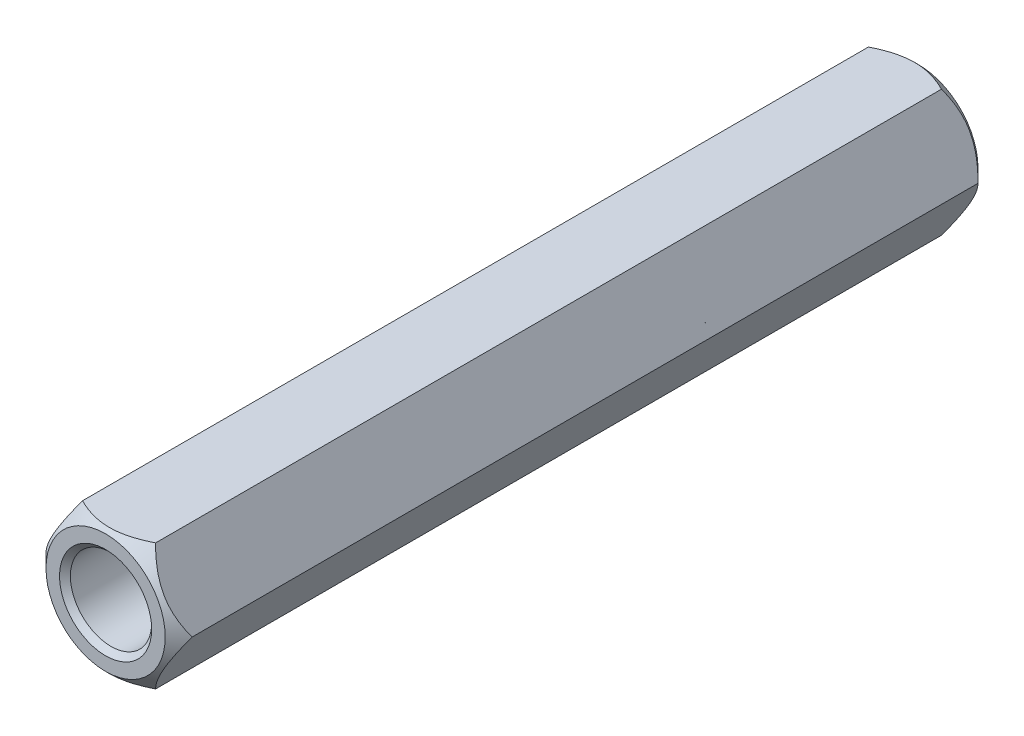
ISO-10303-21;
HEADER;
FILE_DESCRIPTION(('STEP AP214'),'2;1');
FILE_NAME('part.step','',(''),(''),'','','');
FILE_SCHEMA(('AUTOMOTIVE_DESIGN { 1 0 10303 214 1 1 1 1 }'));
ENDSEC;
DATA;
#1=APPLICATION_CONTEXT('core data for automotive mechanical design processes');
#2=APPLICATION_PROTOCOL_DEFINITION('international standard','automotive_design',2000,#1);
#3=PRODUCT_CONTEXT('',#1,'mechanical');
#4=PRODUCT('Part','Part','',(#3));
#5=PRODUCT_RELATED_PRODUCT_CATEGORY('part','',(#4));
#6=PRODUCT_DEFINITION_FORMATION('','',#4);
#7=PRODUCT_DEFINITION_CONTEXT('part definition',#1,'design');
#8=PRODUCT_DEFINITION('design','',#6,#7);
#9=PRODUCT_DEFINITION_SHAPE('','',#8);
#10=(LENGTH_UNIT() NAMED_UNIT(*) SI_UNIT(.MILLI.,.METRE.));
#11=(NAMED_UNIT(*) PLANE_ANGLE_UNIT() SI_UNIT($,.RADIAN.));
#12=(NAMED_UNIT(*) SI_UNIT($,.STERADIAN.) SOLID_ANGLE_UNIT());
#13=UNCERTAINTY_MEASURE_WITH_UNIT(LENGTH_MEASURE(1.E-05),#10,'distance_accuracy_value','');
#14=(GEOMETRIC_REPRESENTATION_CONTEXT(3) GLOBAL_UNCERTAINTY_ASSIGNED_CONTEXT((#13)) GLOBAL_UNIT_ASSIGNED_CONTEXT((#10,
#11,#12)) REPRESENTATION_CONTEXT('',''));
#15=CARTESIAN_POINT('',(0.,0.,0.));
#16=DIRECTION('',(0.,0.,1.));
#17=DIRECTION('',(1.,0.,0.));
#18=AXIS2_PLACEMENT_3D('',#15,#16,#17);
#19=CARTESIAN_POINT('',(0.,0.,30.));
#20=DIRECTION('',(0.,0.,1.));
#21=DIRECTION('',(1.,0.,0.));
#22=AXIS2_PLACEMENT_3D('',#19,#20,#21);
#23=PLANE('',#22);
#24=CARTESIAN_POINT('',(0.,0.,30.));
#25=DIRECTION('',(0.,0.,1.));
#26=DIRECTION('',(1.,0.,0.));
#27=AXIS2_PLACEMENT_3D('',#24,#25,#26);
#28=CIRCLE('',#27,2.19999999999999);
#29=CARTESIAN_POINT('',(2.19999999999999,0.,30.));
#30=VERTEX_POINT('',#29);
#31=EDGE_CURVE('E99',#30,#30,#28,.F.);
#32=ORIENTED_EDGE('',*,*,#31,.F.);
#33=EDGE_LOOP('',(#32));
#34=FACE_BOUND('',#33,.T.);
#35=CARTESIAN_POINT('',(0.,0.,30.));
#36=DIRECTION('',(0.,0.,1.));
#37=DIRECTION('',(1.,0.,0.));
#38=AXIS2_PLACEMENT_3D('',#35,#36,#37);
#39=CIRCLE('',#38,1.7);
#40=CARTESIAN_POINT('',(1.7,0.,30.));
#41=VERTEX_POINT('',#40);
#42=EDGE_CURVE('E251',#41,#41,#39,.T.);
#43=ORIENTED_EDGE('',*,*,#42,.F.);
#44=EDGE_LOOP('',(#43));
#45=FACE_BOUND('',#44,.T.);
#46=ADVANCED_FACE('F35',(#34,#45),#23,.T.);
#47=CARTESIAN_POINT('',(0.,0.,0.));
#48=DIRECTION('',(0.,0.,1.));
#49=DIRECTION('',(1.,0.,0.));
#50=AXIS2_PLACEMENT_3D('',#47,#48,#49);
#51=PLANE('',#50);
#52=CARTESIAN_POINT('',(0.,0.,0.));
#53=DIRECTION('',(0.,0.,1.));
#54=DIRECTION('',(1.,0.,0.));
#55=AXIS2_PLACEMENT_3D('',#52,#53,#54);
#56=CIRCLE('',#55,2.2);
#57=CARTESIAN_POINT('',(2.2,0.,0.));
#58=VERTEX_POINT('',#57);
#59=EDGE_CURVE('E123',#58,#58,#56,.F.);
#60=ORIENTED_EDGE('',*,*,#59,.T.);
#61=EDGE_LOOP('',(#60));
#62=FACE_BOUND('',#61,.T.);
#63=CARTESIAN_POINT('',(0.,0.,0.));
#64=DIRECTION('',(0.,0.,1.));
#65=DIRECTION('',(1.,0.,0.));
#66=AXIS2_PLACEMENT_3D('',#63,#64,#65);
#67=CIRCLE('',#66,1.7);
#68=CARTESIAN_POINT('',(1.7,0.,0.));
#69=VERTEX_POINT('',#68);
#70=EDGE_CURVE('E106',#69,#69,#67,.T.);
#71=ORIENTED_EDGE('',*,*,#70,.T.);
#72=EDGE_LOOP('',(#71));
#73=FACE_BOUND('',#72,.T.);
#74=ADVANCED_FACE('F228',(#62,#73),#51,.F.);
#75=CARTESIAN_POINT('',(1.3481128785578,-2.33499999999999,30.));
#76=DIRECTION('',(-0.866025403784442,0.499999999999995,0.));
#77=DIRECTION('',(-0.499999999999995,-0.866025403784442,0.));
#78=AXIS2_PLACEMENT_3D('',#75,#76,#77);
#79=PLANE('',#78);
#80=DIRECTION('',(0.,0.,-1.));
#81=VECTOR('',#80,1.);
#82=CARTESIAN_POINT('',(2.69622575711555,0.,30.));
#83=LINE('',#82,#81);
#84=CARTESIAN_POINT('',(2.69622575711555,0.,29.5037742428844));
#85=VERTEX_POINT('',#84);
#86=CARTESIAN_POINT('',(2.69622575711555,0.,0.496225757115554));
#87=VERTEX_POINT('',#86);
#88=EDGE_CURVE('E98',#85,#87,#83,.T.);
#89=ORIENTED_EDGE('',*,*,#88,.F.);
#90=CARTESIAN_POINT('',(2.69634122716939,0.0002,29.5036587654131));
#91=CARTESIAN_POINT('',(2.64999896805278,-0.0800671473275003,29.5499624505871));
#92=CARTESIAN_POINT('',(2.60288179501488,-0.161676484938155,29.5935467362657));
#93=CARTESIAN_POINT('',(2.50680463574138,-0.328087006246738,29.6733486729806));
#94=CARTESIAN_POINT('',(2.45783551143744,-0.412904017543331,29.7095219199417));
#95=CARTESIAN_POINT('',(2.35909159907886,-0.583933490686518,29.7714874797951));
#96=CARTESIAN_POINT('',(2.30934196089063,-0.670102391686709,29.7974355479753));
#97=CARTESIAN_POINT('',(2.20874741036639,-0.844337264159239,29.8374140054918));
#98=CARTESIAN_POINT('',(2.15790557142179,-0.93239791236153,29.8514742395698));
#99=CARTESIAN_POINT('',(2.07028306348487,-1.08416454799488,29.8641601600655));
#100=CARTESIAN_POINT('',(2.03361560625516,-1.1476744469011,29.8660381677022));
#101=CARTESIAN_POINT('',(1.96034062254914,-1.2745904416037,29.862874854783));
#102=CARTESIAN_POINT('',(1.92373312158769,-1.33799649320707,29.8578311084065));
#103=CARTESIAN_POINT('',(1.85086377263647,-1.46420990790504,29.8411113074657));
#104=CARTESIAN_POINT('',(1.81460235755789,-1.52701652117548,29.8294278332198));
#105=CARTESIAN_POINT('',(1.74270657248164,-1.65154367377761,29.8000699146832));
#106=CARTESIAN_POINT('',(1.70707215463588,-1.7132642959846,29.7823959296508));
#107=CARTESIAN_POINT('',(1.61579563593186,-1.87135986391798,29.7299259247161));
#108=CARTESIAN_POINT('',(1.56071953029692,-1.96675447716073,29.6911745188085));
#109=CARTESIAN_POINT('',(1.47973498735629,-2.10702382016165,29.6257567100315));
#110=CARTESIAN_POINT('',(1.45304696963845,-2.15324882280225,29.6027718820901));
#111=CARTESIAN_POINT('',(1.40016530130355,-2.2448425591473,29.5547069638151));
#112=CARTESIAN_POINT('',(1.37397135909669,-2.2902117979001,29.529628159944));
#113=CARTESIAN_POINT('',(1.34799740850397,-2.33519999999999,29.5036587654131));
#114=B_SPLINE_CURVE_WITH_KNOTS('',3,(#90,#91,#92,#93,#94,#95,#96,#97,#98,#99,#100,#101,#102,
#103,#104,#105,#106,#107,#108,#109,#110,#111,#112,#113),.UNSPECIFIED.,.F.,.F.,(4,2,2,2,2,2,2,2,
2,2,2,4),(0.,0.311036899492917,0.623886165077383,0.931766434741563,1.23887144764237,
1.45863683386158,1.67847925945319,1.89856783628664,2.11863954399795,2.46821510911984,
2.64252894458997,2.81673646504649),.UNSPECIFIED.);
#115=CARTESIAN_POINT('',(1.3481128785578,-2.33499999999999,29.5037742428844));
#116=VERTEX_POINT('',#115);
#117=EDGE_CURVE('E93',#85,#116,#114,.T.);
#118=ORIENTED_EDGE('',*,*,#117,.T.);
#119=DIRECTION('',(0.,0.,-1.));
#120=VECTOR('',#119,1.);
#121=CARTESIAN_POINT('',(1.3481128785578,-2.33499999999999,30.));
#122=LINE('',#121,#120);
#123=CARTESIAN_POINT('',(1.3481128785578,-2.33499999999999,0.496225757115554));
#124=VERTEX_POINT('',#123);
#125=EDGE_CURVE('E63',#116,#124,#122,.T.);
#126=ORIENTED_EDGE('',*,*,#125,.T.);
#127=CARTESIAN_POINT('',(1.34799740850397,-2.33519999999999,0.496341234586851));
#128=CARTESIAN_POINT('',(1.39433966762058,-2.25493285267249,0.450037549412896));
#129=CARTESIAN_POINT('',(1.44145684065848,-2.17332351506183,0.406453263734269));
#130=CARTESIAN_POINT('',(1.53753399993197,-2.00691299375325,0.326651327019392));
#131=CARTESIAN_POINT('',(1.58650312423592,-1.92209598245666,0.290478080058336));
#132=CARTESIAN_POINT('',(1.6852470365945,-1.75106650931347,0.22851252020485));
#133=CARTESIAN_POINT('',(1.73499667478273,-1.66489760831328,0.202564452024737));
#134=CARTESIAN_POINT('',(1.83559122530696,-1.49066273584075,0.162585994508171));
#135=CARTESIAN_POINT('',(1.88643306425157,-1.40260208763846,0.148525760430214));
#136=CARTESIAN_POINT('',(1.97405557218849,-1.25083545200511,0.135839839934477));
#137=CARTESIAN_POINT('',(2.0107230294182,-1.1873255530989,0.133961832297818));
#138=CARTESIAN_POINT('',(2.08399801312421,-1.06040955839629,0.137125145216999));
#139=CARTESIAN_POINT('',(2.12060551408566,-0.997003506792926,0.142168891593523));
#140=CARTESIAN_POINT('',(2.19347486303688,-0.870790092094951,0.158888692534329));
#141=CARTESIAN_POINT('',(2.22973627811546,-0.807983478824509,0.1705721667802));
#142=CARTESIAN_POINT('',(2.30163206319172,-0.68345632622238,0.19993008531677));
#143=CARTESIAN_POINT('',(2.33726648103747,-0.621735704015393,0.21760407034914));
#144=CARTESIAN_POINT('',(2.42854299974149,-0.463640136082012,0.270074075283872));
#145=CARTESIAN_POINT('',(2.48361910537643,-0.368245522839264,0.308825481191503));
#146=CARTESIAN_POINT('',(2.56460364831707,-0.227976179838338,0.374243289968518));
#147=CARTESIAN_POINT('',(2.59129166603491,-0.181751177197737,0.397228117909856));
#148=CARTESIAN_POINT('',(2.64417333436981,-0.0901574408526869,0.445293036184915));
#149=CARTESIAN_POINT('',(2.67036727657667,-0.0447882020998843,0.470371840056005));
#150=CARTESIAN_POINT('',(2.69634122716939,0.000200000000000119,0.496341234586851));
#151=B_SPLINE_CURVE_WITH_KNOTS('',3,(#127,#128,#129,#130,#131,#132,#133,#134,#135,#136,#137,
#138,#139,#140,#141,#142,#143,#144,#145,#146,#147,#148,#149,#150),.UNSPECIFIED.,.F.,.F.,(4,2,2,
2,2,2,2,2,2,2,2,4),(0.,0.311036899492915,0.623886165077381,0.93176643474156,1.23887144764236,
1.45863683386158,1.67847925945319,1.89856783628663,2.11863954399794,2.46821510911984,
2.64252894458997,2.81673646504649),.UNSPECIFIED.);
#152=EDGE_CURVE('E171',#124,#87,#151,.T.);
#153=ORIENTED_EDGE('',*,*,#152,.T.);
#154=EDGE_LOOP('',(#89,#118,#126,#153));
#155=FACE_BOUND('',#154,.T.);
#156=ADVANCED_FACE('F37',(#155),#79,.F.);
#157=CARTESIAN_POINT('',(2.69622575711555,0.,30.));
#158=DIRECTION('',(-0.866025403784438,-0.500000000000001,0.));
#159=DIRECTION('',(0.500000000000001,-0.866025403784438,0.));
#160=AXIS2_PLACEMENT_3D('',#157,#158,#159);
#161=PLANE('',#160);
#162=DIRECTION('',(0.,0.,-1.));
#163=VECTOR('',#162,1.);
#164=CARTESIAN_POINT('',(1.34811287855777,2.335,30.));
#165=LINE('',#164,#163);
#166=CARTESIAN_POINT('',(1.34811287855777,2.335,29.5037742428844));
#167=VERTEX_POINT('',#166);
#168=CARTESIAN_POINT('',(1.34811287855777,2.335,0.496225757115554));
#169=VERTEX_POINT('',#168);
#170=EDGE_CURVE('E118',#167,#169,#165,.T.);
#171=ORIENTED_EDGE('',*,*,#170,.F.);
#172=CARTESIAN_POINT('',(1.34799740850393,2.3352,29.5036587654131));
#173=CARTESIAN_POINT('',(1.39433966762055,2.2549328526725,29.5499624505871));
#174=CARTESIAN_POINT('',(1.44145684065845,2.17332351506185,29.5935467362657));
#175=CARTESIAN_POINT('',(1.53753399993195,2.00691299375327,29.6733486729806));
#176=CARTESIAN_POINT('',(1.58650312423589,1.92209598245667,29.7095219199417));
#177=CARTESIAN_POINT('',(1.68524703659447,1.75106650931348,29.7714874797951));
#178=CARTESIAN_POINT('',(1.73499667478271,1.66489760831329,29.7974355479753));
#179=CARTESIAN_POINT('',(1.83559122530694,1.49066273584076,29.8374140054918));
#180=CARTESIAN_POINT('',(1.88643306425155,1.40260208763847,29.8514742395698));
#181=CARTESIAN_POINT('',(1.97405557218847,1.25083545200512,29.8641601600655));
#182=CARTESIAN_POINT('',(2.01072302941818,1.18732555309891,29.8660381677022));
#183=CARTESIAN_POINT('',(2.0839980131242,1.0604095583963,29.862874854783));
#184=CARTESIAN_POINT('',(2.12060551408565,0.997003506792939,29.8578311084065));
#185=CARTESIAN_POINT('',(2.19347486303687,0.870790092094964,29.8411113074657));
#186=CARTESIAN_POINT('',(2.22973627811545,0.807983478824522,29.8294278332198));
#187=CARTESIAN_POINT('',(2.3016320631917,0.683456326222394,29.8000699146832));
#188=CARTESIAN_POINT('',(2.33726648103746,0.621735704015407,29.7823959296509));
#189=CARTESIAN_POINT('',(2.42854299974148,0.463640136082023,29.7299259247161));
#190=CARTESIAN_POINT('',(2.48361910537642,0.368245522839273,29.6911745188085));
#191=CARTESIAN_POINT('',(2.56460364831706,0.227976179838345,29.6257567100315));
#192=CARTESIAN_POINT('',(2.59129166603491,0.181751177197743,29.6027718820901));
#193=CARTESIAN_POINT('',(2.64417333436981,0.0901574408526912,29.5547069638151));
#194=CARTESIAN_POINT('',(2.67036727657666,0.0447882020998873,29.529628159944));
#195=CARTESIAN_POINT('',(2.69634122716939,-0.000199999999998977,29.5036587654131));
#196=B_SPLINE_CURVE_WITH_KNOTS('',3,(#172,#173,#174,#175,#176,#177,#178,#179,#180,#181,#182,
#183,#184,#185,#186,#187,#188,#189,#190,#191,#192,#193,#194,#195),.UNSPECIFIED.,.F.,.F.,(4,2,2,
2,2,2,2,2,2,2,2,4),(0.,0.311036899492919,0.623886165077387,0.93176643474157,1.23887144764238,
1.45863683386159,1.6784792594532,1.89856783628665,2.11863954399795,2.46821510911986,
2.64252894459,2.81673646504652),.UNSPECIFIED.);
#197=EDGE_CURVE('E100',#167,#85,#196,.T.);
#198=ORIENTED_EDGE('',*,*,#197,.T.);
#199=ORIENTED_EDGE('',*,*,#88,.T.);
#200=CARTESIAN_POINT('',(2.69634122716939,-0.000200000000000061,0.496341234586851));
#201=CARTESIAN_POINT('',(2.64999896805278,0.080067147327499,0.450037549412895));
#202=CARTESIAN_POINT('',(2.60288179501488,0.161676484938153,0.406453263734267));
#203=CARTESIAN_POINT('',(2.50680463574138,0.328087006246737,0.326651327019388));
#204=CARTESIAN_POINT('',(2.45783551143743,0.412904017543331,0.290478080058332));
#205=CARTESIAN_POINT('',(2.35909159907885,0.583933490686519,0.228512520204844));
#206=CARTESIAN_POINT('',(2.30934196089062,0.67010239168671,0.20256445202473));
#207=CARTESIAN_POINT('',(2.20874741036638,0.84433726415924,0.162585994508163));
#208=CARTESIAN_POINT('',(2.15790557142178,0.932397912361532,0.148525760430205));
#209=CARTESIAN_POINT('',(2.07028306348486,1.08416454799488,0.135839839934468));
#210=CARTESIAN_POINT('',(2.03361560625515,1.1476744469011,0.133961832297809));
#211=CARTESIAN_POINT('',(1.96034062254913,1.2745904416037,0.137125145216989));
#212=CARTESIAN_POINT('',(1.92373312158768,1.33799649320706,0.142168891593512));
#213=CARTESIAN_POINT('',(1.85086377263646,1.46420990790504,0.158888692534319));
#214=CARTESIAN_POINT('',(1.81460235755788,1.52701652117548,0.17057216678019));
#215=CARTESIAN_POINT('',(1.74270657248163,1.65154367377761,0.199930085316759));
#216=CARTESIAN_POINT('',(1.70707215463587,1.71326429598459,0.21760407034913));
#217=CARTESIAN_POINT('',(1.61579563593185,1.87135986391798,0.270074075283863));
#218=CARTESIAN_POINT('',(1.5607195302969,1.96675447716073,0.308825481191494));
#219=CARTESIAN_POINT('',(1.47973498735626,2.10702382016166,0.374243289968512));
#220=CARTESIAN_POINT('',(1.45304696963842,2.15324882280226,0.397228117909851));
#221=CARTESIAN_POINT('',(1.40016530130352,2.24484255914731,0.445293036184912));
#222=CARTESIAN_POINT('',(1.37397135909666,2.29021179790012,0.470371840056004));
#223=CARTESIAN_POINT('',(1.34799740850393,2.3352,0.496341234586851));
#224=B_SPLINE_CURVE_WITH_KNOTS('',3,(#200,#201,#202,#203,#204,#205,#206,#207,#208,#209,#210,
#211,#212,#213,#214,#215,#216,#217,#218,#219,#220,#221,#222,#223),.UNSPECIFIED.,.F.,.F.,(4,2,2,
2,2,2,2,2,2,2,2,4),(0.,0.311036899492919,0.623886165077388,0.931766434741572,1.23887144764238,
1.45863683386159,1.6784792594532,1.89856783628665,2.11863954399795,2.46821510911987,
2.64252894459,2.81673646504653),.UNSPECIFIED.);
#225=EDGE_CURVE('E166',#87,#169,#224,.T.);
#226=ORIENTED_EDGE('',*,*,#225,.T.);
#227=EDGE_LOOP('',(#171,#198,#199,#226));
#228=FACE_BOUND('',#227,.T.);
#229=ADVANCED_FACE('F175',(#228),#161,.F.);
#230=CARTESIAN_POINT('',(1.34811287855777,2.335,30.));
#231=DIRECTION('',(0.,-1.,0.));
#232=DIRECTION('',(1.,0.,0.));
#233=AXIS2_PLACEMENT_3D('',#230,#231,#232);
#234=PLANE('',#233);
#235=DIRECTION('',(0.,0.,-1.));
#236=VECTOR('',#235,1.);
#237=CARTESIAN_POINT('',(-1.34811287855779,2.335,30.));
#238=LINE('',#237,#236);
#239=CARTESIAN_POINT('',(-1.34811287855779,2.33499999999999,29.5037742428844));
#240=VERTEX_POINT('',#239);
#241=CARTESIAN_POINT('',(-1.34811287855779,2.335,0.496225757115554));
#242=VERTEX_POINT('',#241);
#243=EDGE_CURVE('E116',#240,#242,#238,.T.);
#244=ORIENTED_EDGE('',*,*,#243,.F.);
#245=CARTESIAN_POINT('',(-3.3314861123049,2.33499999999999,28.1317049373871));
#246=CARTESIAN_POINT('',(-3.24760864956221,2.33499999999999,28.2003738717275));
#247=CARTESIAN_POINT('',(-3.16332504983487,2.33499999999999,28.2685545638786));
#248=CARTESIAN_POINT('',(-2.99373947808682,2.33499999999999,28.4036809746011));
#249=CARTESIAN_POINT('',(-2.90843725161757,2.33499999999999,28.4706263735029));
#250=CARTESIAN_POINT('',(-2.73570903484849,2.33499999999999,28.6037141276054));
#251=CARTESIAN_POINT('',(-2.64827001315744,2.33499999999999,28.6698396257034));
#252=CARTESIAN_POINT('',(-2.47194348423723,2.33499999999999,28.8001180758694));
#253=CARTESIAN_POINT('',(-2.38305611718205,2.33499999999999,28.8642712171117));
#254=CARTESIAN_POINT('',(-2.19523158372747,2.33499999999999,28.9958830607919));
#255=CARTESIAN_POINT('',(-2.09612417893187,2.33499999999999,29.063100191962));
#256=CARTESIAN_POINT('',(-1.89528137747465,2.33499999999999,29.193593018448));
#257=CARTESIAN_POINT('',(-1.79354514509364,2.33499999999999,29.2568674379911));
#258=CARTESIAN_POINT('',(-1.58736988009919,2.33499999999999,29.3777629893548));
#259=CARTESIAN_POINT('',(-1.48294550898283,2.33499999999999,29.4354088930693));
#260=CARTESIAN_POINT('',(-1.27040131722182,2.335,29.543353357851));
#261=CARTESIAN_POINT('',(-1.16228476861007,2.335,29.5936582262565));
#262=CARTESIAN_POINT('',(-0.973257667346179,2.335,29.6713040127211));
#263=CARTESIAN_POINT('',(-0.89336510752265,2.335,29.7011053105469));
#264=CARTESIAN_POINT('',(-0.731430366419,2.335,29.7543158078901));
#265=CARTESIAN_POINT('',(-0.649387891876155,2.335,29.7777241303364));
#266=CARTESIAN_POINT('',(-0.485288961888538,2.335,29.8164057072978));
#267=CARTESIAN_POINT('',(-0.403272868196742,2.335,29.8318472796415));
#268=CARTESIAN_POINT('',(-0.238088582648409,2.335,29.8543172856514));
#269=CARTESIAN_POINT('',(-0.1549206660417,2.335,29.861347695393));
#270=CARTESIAN_POINT('',(0.00742743041396189,2.335,29.8663256516309));
#271=CARTESIAN_POINT('',(0.0865939402234688,2.335,29.8647194828191));
#272=CARTESIAN_POINT('',(0.244360281962248,2.335,29.8535681491825));
#273=CARTESIAN_POINT('',(0.322960072803612,2.335,29.8440224144515));
#274=CARTESIAN_POINT('',(0.48039848928136,2.335,29.8173825919411));
#275=CARTESIAN_POINT('',(0.559212853857413,2.335,29.8001474267963));
#276=CARTESIAN_POINT('',(0.715075777669906,2.335,29.7591179685408));
#277=CARTESIAN_POINT('',(0.792124376518921,2.335,29.7353238227282));
#278=CARTESIAN_POINT('',(1.02474008406607,2.335,29.6542720094116));
#279=CARTESIAN_POINT('',(1.17725068222038,2.335,29.5882210206723));
#280=CARTESIAN_POINT('',(1.40047870563342,2.335,29.4779816896401));
#281=CARTESIAN_POINT('',(1.47409967756427,2.33500000000001,29.4392905524874));
#282=CARTESIAN_POINT('',(1.61967925684458,2.33500000000001,29.3588911626996));
#283=CARTESIAN_POINT('',(1.69163814862513,2.33500000000001,29.3171834314162));
#284=CARTESIAN_POINT('',(1.83056332033799,2.33500000000001,29.2334751465107));
#285=CARTESIAN_POINT('',(1.89760054456543,2.33500000000001,29.1915910175006));
#286=CARTESIAN_POINT('',(2.03052455258961,2.33500000000001,29.1060269247717));
#287=CARTESIAN_POINT('',(2.09641125049928,2.33500000000001,29.0623468277931));
#288=CARTESIAN_POINT('',(2.22665720615455,2.33500000000001,28.9738633577353));
#289=CARTESIAN_POINT('',(2.29102444519271,2.33500000000001,28.9290716842917));
#290=CARTESIAN_POINT('',(2.41887418203325,2.33500000000001,28.8382783879837));
#291=CARTESIAN_POINT('',(2.48235691874979,2.33500000000001,28.7922771019377));
#292=CARTESIAN_POINT('',(2.5454684007517,2.33500000000001,28.7457802068737));
#293=B_SPLINE_CURVE_WITH_KNOTS('',3,(#245,#246,#247,#248,#249,#250,#251,#252,#253,#254,#255,
#256,#257,#258,#259,#260,#261,#262,#263,#264,#265,#266,#267,#268,#269,#270,#271,#272,#273,#274,
#275,#276,#277,#278,#279,#280,#281,#282,#283,#284,#285,#286,#287,#288,#289,#290,#291,#292),
.UNSPECIFIED.,.F.,.F.,(4,2,2,2,2,2,2,2,2,2,2,2,2,2,2,2,2,2,2,2,2,2,2,4),(0.,0.32520955793558,
0.650502125715399,0.979361927679472,1.30819008873637,1.66737430183983,2.02667414170443,
2.38431371438759,2.74164417463447,2.99724003793781,3.25287094959843,3.50285365347003,
3.7527776161471,3.98991527703869,4.22706996126151,4.46876705048104,4.71045871223385,
5.20752705328328,5.45701130369389,5.70645253881891,5.94356135969679,6.18068780578425,
6.41592793587181,6.65110324250412),.UNSPECIFIED.);
#294=EDGE_CURVE('E187',#240,#167,#293,.T.);
#295=ORIENTED_EDGE('',*,*,#294,.T.);
#296=ORIENTED_EDGE('',*,*,#170,.T.);
#297=CARTESIAN_POINT('',(-3.3314861123049,2.33499999999999,1.86829506261288));
#298=CARTESIAN_POINT('',(-3.24760864956221,2.33499999999999,1.79962612827246));
#299=CARTESIAN_POINT('',(-3.16332504983486,2.33499999999999,1.73144543612141));
#300=CARTESIAN_POINT('',(-2.99373947808682,2.33499999999999,1.59631902539892));
#301=CARTESIAN_POINT('',(-2.90843725161757,2.33499999999999,1.52937362649706));
#302=CARTESIAN_POINT('',(-2.73570903484849,2.33499999999999,1.39628587239459));
#303=CARTESIAN_POINT('',(-2.64827001315744,2.33499999999999,1.33016037429658));
#304=CARTESIAN_POINT('',(-2.47194348423723,2.33499999999999,1.19988192413062));
#305=CARTESIAN_POINT('',(-2.38305611718206,2.33499999999999,1.13572878288832));
#306=CARTESIAN_POINT('',(-2.19523158372748,2.33499999999999,1.00411693920811));
#307=CARTESIAN_POINT('',(-2.09612417893187,2.33499999999999,0.936899808037992));
#308=CARTESIAN_POINT('',(-1.89528137747465,2.33499999999999,0.80640698155203));
#309=CARTESIAN_POINT('',(-1.79354514509364,2.33499999999999,0.743132562008898));
#310=CARTESIAN_POINT('',(-1.5873698800992,2.33499999999999,0.622237010645202));
#311=CARTESIAN_POINT('',(-1.48294550898283,2.33499999999999,0.564591106930731));
#312=CARTESIAN_POINT('',(-1.27040131722183,2.335,0.456646642148956));
#313=CARTESIAN_POINT('',(-1.16228476861007,2.335,0.406341773743448));
#314=CARTESIAN_POINT('',(-0.973257667346181,2.335,0.328695987278869));
#315=CARTESIAN_POINT('',(-0.893365107522653,2.335,0.298894689453133));
#316=CARTESIAN_POINT('',(-0.731430366419004,2.335,0.245684192109907));
#317=CARTESIAN_POINT('',(-0.649387891876158,2.335,0.222275869663613));
#318=CARTESIAN_POINT('',(-0.485288961888543,2.335,0.183594292702211));
#319=CARTESIAN_POINT('',(-0.403272868196746,2.335,0.168152720358536));
#320=CARTESIAN_POINT('',(-0.238088582648414,2.335,0.145682714348625));
#321=CARTESIAN_POINT('',(-0.154920666041705,2.335,0.138652304606977));
#322=CARTESIAN_POINT('',(0.00742743041395542,2.335,0.133674348369059));
#323=CARTESIAN_POINT('',(0.0865939402234623,2.335,0.135280517180887));
#324=CARTESIAN_POINT('',(0.244360281962242,2.335,0.146431850817537));
#325=CARTESIAN_POINT('',(0.322960072803606,2.335,0.155977585548444));
#326=CARTESIAN_POINT('',(0.480398489281353,2.335,0.18261740805888));
#327=CARTESIAN_POINT('',(0.559212853857406,2.335,0.199852573203677));
#328=CARTESIAN_POINT('',(0.715075777669899,2.335,0.240882031459213));
#329=CARTESIAN_POINT('',(0.792124376518914,2.335,0.264676177271738));
#330=CARTESIAN_POINT('',(1.02474008406607,2.335,0.345727990588433));
#331=CARTESIAN_POINT('',(1.17725068222037,2.335,0.411778979327721));
#332=CARTESIAN_POINT('',(1.40047870563341,2.335,0.522018310359908));
#333=CARTESIAN_POINT('',(1.47409967756425,2.33500000000001,0.560709447512581));
#334=CARTESIAN_POINT('',(1.61967925684457,2.33500000000001,0.641108837300349));
#335=CARTESIAN_POINT('',(1.69163814862511,2.33500000000001,0.682816568583738));
#336=CARTESIAN_POINT('',(1.83056332033797,2.33500000000001,0.766524853489314));
#337=CARTESIAN_POINT('',(1.89760054456541,2.33500000000001,0.808408982499376));
#338=CARTESIAN_POINT('',(2.03052455258959,2.33500000000001,0.893973075228248));
#339=CARTESIAN_POINT('',(2.09641125049927,2.33500000000001,0.937653172206919));
#340=CARTESIAN_POINT('',(2.22665720615453,2.33500000000001,1.02613664226472));
#341=CARTESIAN_POINT('',(2.29102444519269,2.33500000000001,1.07092831570824));
#342=CARTESIAN_POINT('',(2.41887418203323,2.33500000000001,1.16172161201625));
#343=CARTESIAN_POINT('',(2.48235691874977,2.33500000000001,1.2077228980623));
#344=CARTESIAN_POINT('',(2.54546840075167,2.33500000000001,1.25421979312628));
#345=B_SPLINE_CURVE_WITH_KNOTS('',3,(#297,#298,#299,#300,#301,#302,#303,#304,#305,#306,#307,
#308,#309,#310,#311,#312,#313,#314,#315,#316,#317,#318,#319,#320,#321,#322,#323,#324,#325,#326,
#327,#328,#329,#330,#331,#332,#333,#334,#335,#336,#337,#338,#339,#340,#341,#342,#343,#344),
.UNSPECIFIED.,.F.,.F.,(4,2,2,2,2,2,2,2,2,2,2,2,2,2,2,2,2,2,2,2,2,2,2,4),(0.,0.325209557935581,
0.6505021257154,0.979361927679472,1.30819008873637,1.66737430183983,2.02667414170443,
2.38431371438759,2.74164417463447,2.99724003793781,3.25287094959843,3.50285365347003,
3.7527776161471,3.98991527703869,4.22706996126151,4.46876705048103,4.71045871223384,
5.20752705328327,5.45701130369387,5.70645253881889,5.94356135969678,6.18068780578423,
6.41592793587179,6.6511032425041),.UNSPECIFIED.);
#346=EDGE_CURVE('E160',#169,#242,#345,.F.);
#347=ORIENTED_EDGE('',*,*,#346,.T.);
#348=EDGE_LOOP('',(#244,#295,#296,#347));
#349=FACE_BOUND('',#348,.T.);
#350=ADVANCED_FACE('F178',(#349),#234,.F.);
#351=CARTESIAN_POINT('',(-1.34811287855779,2.335,30.));
#352=DIRECTION('',(0.866025403784441,-0.499999999999995,0.));
#353=DIRECTION('',(0.499999999999995,0.866025403784441,0.));
#354=AXIS2_PLACEMENT_3D('',#351,#352,#353);
#355=PLANE('',#354);
#356=DIRECTION('',(0.,0.,-1.));
#357=VECTOR('',#356,1.);
#358=CARTESIAN_POINT('',(-2.69622575711555,0.,30.));
#359=LINE('',#358,#357);
#360=CARTESIAN_POINT('',(-2.69622575711555,0.,29.5037742428844));
#361=VERTEX_POINT('',#360);
#362=CARTESIAN_POINT('',(-2.69622575711555,0.,0.496225757115554));
#363=VERTEX_POINT('',#362);
#364=EDGE_CURVE('E108',#361,#363,#359,.T.);
#365=ORIENTED_EDGE('',*,*,#364,.F.);
#366=CARTESIAN_POINT('',(-2.69634122716939,-0.00020000000001847,29.5036587654131));
#367=CARTESIAN_POINT('',(-2.64999896805278,0.0800671473274816,29.5499624505871));
#368=CARTESIAN_POINT('',(-2.60288179501488,0.161676484938137,29.5935467362657));
#369=CARTESIAN_POINT('',(-2.50680463574138,0.328087006246721,29.6733486729806));
#370=CARTESIAN_POINT('',(-2.45783551143744,0.412904017543315,29.7095219199417));
#371=CARTESIAN_POINT('',(-2.35909159907886,0.583933490686504,29.7714874797951));
#372=CARTESIAN_POINT('',(-2.30934196089062,0.670102391686696,29.7974355479753));
#373=CARTESIAN_POINT('',(-2.20874741036639,0.844337264159227,29.8374140054918));
#374=CARTESIAN_POINT('',(-2.15790557142178,0.93239791236152,29.8514742395698));
#375=CARTESIAN_POINT('',(-2.07028306348486,1.08416454799487,29.8641601600655));
#376=CARTESIAN_POINT('',(-2.03361560625516,1.14767444690109,29.8660381677022));
#377=CARTESIAN_POINT('',(-1.96034062254914,1.27459044160369,29.862874854783));
#378=CARTESIAN_POINT('',(-1.92373312158769,1.33799649320706,29.8578311084065));
#379=CARTESIAN_POINT('',(-1.85086377263647,1.46420990790503,29.8411113074657));
#380=CARTESIAN_POINT('',(-1.81460235755789,1.52701652117547,29.8294278332198));
#381=CARTESIAN_POINT('',(-1.74270657248163,1.6515436737776,29.8000699146832));
#382=CARTESIAN_POINT('',(-1.70707215463588,1.71326429598459,29.7823959296509));
#383=CARTESIAN_POINT('',(-1.61579563593186,1.87135986391797,29.7299259247161));
#384=CARTESIAN_POINT('',(-1.56071953029691,1.96675447716072,29.6911745188085));
#385=CARTESIAN_POINT('',(-1.47973498735628,2.10702382016165,29.6257567100315));
#386=CARTESIAN_POINT('',(-1.45304696963843,2.15324882280225,29.6027718820901));
#387=CARTESIAN_POINT('',(-1.40016530130354,2.2448425591473,29.5547069638151));
#388=CARTESIAN_POINT('',(-1.37397135909668,2.29021179790011,29.529628159944));
#389=CARTESIAN_POINT('',(-1.34799740850395,2.33519999999999,29.5036587654131));
#390=B_SPLINE_CURVE_WITH_KNOTS('',3,(#366,#367,#368,#369,#370,#371,#372,#373,#374,#375,#376,
#377,#378,#379,#380,#381,#382,#383,#384,#385,#386,#387,#388,#389),.UNSPECIFIED.,.F.,.F.,(4,2,2,
2,2,2,2,2,2,2,2,4),(0.,0.31103689949292,0.623886165077388,0.931766434741572,1.23887144764238,
1.45863683386159,1.6784792594532,1.89856783628665,2.11863954399796,2.46821510911987,
2.64252894459,2.81673646504652),.UNSPECIFIED.);
#391=EDGE_CURVE('E208',#361,#240,#390,.T.);
#392=ORIENTED_EDGE('',*,*,#391,.T.);
#393=ORIENTED_EDGE('',*,*,#243,.T.);
#394=CARTESIAN_POINT('',(-1.34799740850395,2.3352,0.49634123458685));
#395=CARTESIAN_POINT('',(-1.39433966762056,2.2549328526725,0.450037549412894));
#396=CARTESIAN_POINT('',(-1.44145684065846,2.17332351506184,0.406453263734266));
#397=CARTESIAN_POINT('',(-1.53753399993196,2.00691299375326,0.326651327019387));
#398=CARTESIAN_POINT('',(-1.58650312423591,1.92209598245666,0.290478080058331));
#399=CARTESIAN_POINT('',(-1.68524703659448,1.75106650931347,0.228512520204843));
#400=CARTESIAN_POINT('',(-1.73499667478272,1.66489760831328,0.202564452024729));
#401=CARTESIAN_POINT('',(-1.83559122530695,1.49066273584075,0.162585994508162));
#402=CARTESIAN_POINT('',(-1.88643306425156,1.40260208763846,0.148525760430205));
#403=CARTESIAN_POINT('',(-1.97405557218848,1.25083545200511,0.135839839934468));
#404=CARTESIAN_POINT('',(-2.01072302941818,1.18732555309889,0.133961832297808));
#405=CARTESIAN_POINT('',(-2.0839980131242,1.06040955839629,0.137125145216989));
#406=CARTESIAN_POINT('',(-2.12060551408565,0.997003506792926,0.142168891593512));
#407=CARTESIAN_POINT('',(-2.19347486303687,0.87079009209495,0.158888692534319));
#408=CARTESIAN_POINT('',(-2.22973627811545,0.807983478824508,0.17057216678019));
#409=CARTESIAN_POINT('',(-2.3016320631917,0.68345632622238,0.199930085316759));
#410=CARTESIAN_POINT('',(-2.33726648103746,0.621735704015393,0.21760407034913));
#411=CARTESIAN_POINT('',(-2.42854299974148,0.463640136082009,0.270074075283862));
#412=CARTESIAN_POINT('',(-2.48361910537643,0.368245522839258,0.308825481191494));
#413=CARTESIAN_POINT('',(-2.56460364831706,0.227976179838327,0.374243289968512));
#414=CARTESIAN_POINT('',(-2.59129166603491,0.181751177197725,0.397228117909852));
#415=CARTESIAN_POINT('',(-2.64417333436981,0.0901574408526713,0.445293036184913));
#416=CARTESIAN_POINT('',(-2.67036727657667,0.0447882020998673,0.470371840056005));
#417=CARTESIAN_POINT('',(-2.69634122716939,-0.000200000000018983,0.496341234586851));
#418=B_SPLINE_CURVE_WITH_KNOTS('',3,(#394,#395,#396,#397,#398,#399,#400,#401,#402,#403,#404,
#405,#406,#407,#408,#409,#410,#411,#412,#413,#414,#415,#416,#417),.UNSPECIFIED.,.F.,.F.,(4,2,2,
2,2,2,2,2,2,2,2,4),(0.,0.311036899492919,0.623886165077389,0.931766434741572,1.23887144764238,
1.45863683386159,1.6784792594532,1.89856783628665,2.11863954399795,2.46821510911987,
2.64252894459,2.81673646504653),.UNSPECIFIED.);
#419=EDGE_CURVE('E154',#242,#363,#418,.T.);
#420=ORIENTED_EDGE('',*,*,#419,.T.);
#421=EDGE_LOOP('',(#365,#392,#393,#420));
#422=FACE_BOUND('',#421,.T.);
#423=ADVANCED_FACE('F213',(#422),#355,.F.);
#424=CARTESIAN_POINT('',(-2.69622575711555,0.,30.));
#425=DIRECTION('',(0.866025403784435,0.500000000000007,0.));
#426=DIRECTION('',(-0.500000000000007,0.866025403784435,0.));
#427=AXIS2_PLACEMENT_3D('',#424,#425,#426);
#428=PLANE('',#427);
#429=DIRECTION('',(0.,0.,-1.));
#430=VECTOR('',#429,1.);
#431=CARTESIAN_POINT('',(-1.34811287855776,-2.33500000000001,30.));
#432=LINE('',#431,#430);
#433=CARTESIAN_POINT('',(-1.34811287855776,-2.33500000000001,29.5037742428844));
#434=VERTEX_POINT('',#433);
#435=CARTESIAN_POINT('',(-1.34811287855776,-2.33500000000001,0.496225757115554));
#436=VERTEX_POINT('',#435);
#437=EDGE_CURVE('E105',#434,#436,#432,.T.);
#438=ORIENTED_EDGE('',*,*,#437,.F.);
#439=CARTESIAN_POINT('',(-1.34799740850392,-2.33520000000001,29.5036587654131));
#440=CARTESIAN_POINT('',(-1.39433966762053,-2.25493285267251,29.5499624505871));
#441=CARTESIAN_POINT('',(-1.44145684065843,-2.17332351506186,29.5935467362657));
#442=CARTESIAN_POINT('',(-1.53753399993193,-2.00691299375328,29.6733486729806));
#443=CARTESIAN_POINT('',(-1.58650312423588,-1.92209598245668,29.7095219199417));
#444=CARTESIAN_POINT('',(-1.68524703659446,-1.7510665093135,29.7714874797951));
#445=CARTESIAN_POINT('',(-1.7349966747827,-1.66489760831331,29.7974355479753));
#446=CARTESIAN_POINT('',(-1.83559122530693,-1.49066273584078,29.8374140054918));
#447=CARTESIAN_POINT('',(-1.88643306425154,-1.40260208763849,29.8514742395698));
#448=CARTESIAN_POINT('',(-1.97405557218846,-1.25083545200514,29.8641601600655));
#449=CARTESIAN_POINT('',(-2.01072302941817,-1.18732555309892,29.8660381677022));
#450=CARTESIAN_POINT('',(-2.08399801312419,-1.06040955839632,29.862874854783));
#451=CARTESIAN_POINT('',(-2.12060551408564,-0.997003506792953,29.8578311084065));
#452=CARTESIAN_POINT('',(-2.19347486303686,-0.870790092094978,29.8411113074657));
#453=CARTESIAN_POINT('',(-2.22973627811544,-0.807983478824536,29.8294278332198));
#454=CARTESIAN_POINT('',(-2.3016320631917,-0.683456326222409,29.8000699146832));
#455=CARTESIAN_POINT('',(-2.33726648103745,-0.621735704015422,29.7823959296509));
#456=CARTESIAN_POINT('',(-2.42854299974148,-0.46364013608204,29.7299259247161));
#457=CARTESIAN_POINT('',(-2.48361910537642,-0.36824552283929,29.6911745188085));
#458=CARTESIAN_POINT('',(-2.56460364831706,-0.227976179838362,29.6257567100315));
#459=CARTESIAN_POINT('',(-2.5912916660349,-0.181751177197761,29.6027718820901));
#460=CARTESIAN_POINT('',(-2.64417333436981,-0.0901574408527092,29.5547069638151));
#461=CARTESIAN_POINT('',(-2.67036727657667,-0.0447882020999055,29.529628159944));
#462=CARTESIAN_POINT('',(-2.69634122716939,0.000199999999980846,29.5036587654131));
#463=B_SPLINE_CURVE_WITH_KNOTS('',3,(#439,#440,#441,#442,#443,#444,#445,#446,#447,#448,#449,
#450,#451,#452,#453,#454,#455,#456,#457,#458,#459,#460,#461,#462),.UNSPECIFIED.,.F.,.F.,(4,2,2,
2,2,2,2,2,2,2,2,4),(0.,0.311036899492919,0.623886165077387,0.93176643474157,1.23887144764238,
1.45863683386159,1.6784792594532,1.89856783628665,2.11863954399796,2.46821510911986,
2.64252894459,2.81673646504652),.UNSPECIFIED.);
#464=EDGE_CURVE('E56',#434,#361,#463,.T.);
#465=ORIENTED_EDGE('',*,*,#464,.T.);
#466=ORIENTED_EDGE('',*,*,#364,.T.);
#467=CARTESIAN_POINT('',(-2.69634122716939,0.000199999999981232,0.496341234586851));
#468=CARTESIAN_POINT('',(-2.64999896805278,-0.0800671473275173,0.450037549412895));
#469=CARTESIAN_POINT('',(-2.60288179501488,-0.161676484938171,0.406453263734267));
#470=CARTESIAN_POINT('',(-2.50680463574138,-0.328087006246754,0.326651327019388));
#471=CARTESIAN_POINT('',(-2.45783551143743,-0.412904017543348,0.290478080058332));
#472=CARTESIAN_POINT('',(-2.35909159907885,-0.583933490686536,0.228512520204844));
#473=CARTESIAN_POINT('',(-2.30934196089061,-0.670102391686726,0.20256445202473));
#474=CARTESIAN_POINT('',(-2.20874741036638,-0.844337264159255,0.162585994508163));
#475=CARTESIAN_POINT('',(-2.15790557142177,-0.932397912361547,0.148525760430205));
#476=CARTESIAN_POINT('',(-2.07028306348485,-1.0841645479949,0.135839839934468));
#477=CARTESIAN_POINT('',(-2.03361560625514,-1.14767444690111,0.133961832297809));
#478=CARTESIAN_POINT('',(-1.96034062254912,-1.27459044160372,0.137125145216989));
#479=CARTESIAN_POINT('',(-1.92373312158767,-1.33799649320708,0.142168891593513));
#480=CARTESIAN_POINT('',(-1.85086377263645,-1.46420990790505,0.158888692534319));
#481=CARTESIAN_POINT('',(-1.81460235755787,-1.52701652117549,0.17057216678019));
#482=CARTESIAN_POINT('',(-1.74270657248161,-1.65154367377762,0.199930085316759));
#483=CARTESIAN_POINT('',(-1.70707215463586,-1.71326429598461,0.21760407034913));
#484=CARTESIAN_POINT('',(-1.61579563593183,-1.87135986391799,0.270074075283862));
#485=CARTESIAN_POINT('',(-1.56071953029689,-1.96675447716074,0.308825481191493));
#486=CARTESIAN_POINT('',(-1.47973498735625,-2.10702382016167,0.374243289968512));
#487=CARTESIAN_POINT('',(-1.4530469696384,-2.15324882280227,0.397228117909851));
#488=CARTESIAN_POINT('',(-1.4001653013035,-2.24484255914732,0.445293036184912));
#489=CARTESIAN_POINT('',(-1.37397135909664,-2.29021179790013,0.470371840056004));
#490=CARTESIAN_POINT('',(-1.34799740850392,-2.33520000000001,0.49634123458685));
#491=B_SPLINE_CURVE_WITH_KNOTS('',3,(#467,#468,#469,#470,#471,#472,#473,#474,#475,#476,#477,
#478,#479,#480,#481,#482,#483,#484,#485,#486,#487,#488,#489,#490),.UNSPECIFIED.,.F.,.F.,(4,2,2,
2,2,2,2,2,2,2,2,4),(0.,0.311036899492919,0.623886165077388,0.931766434741571,1.23887144764238,
1.45863683386159,1.6784792594532,1.89856783628665,2.11863954399795,2.46821510911987,
2.64252894459,2.81673646504653),.UNSPECIFIED.);
#492=EDGE_CURVE('E147',#363,#436,#491,.T.);
#493=ORIENTED_EDGE('',*,*,#492,.T.);
#494=EDGE_LOOP('',(#438,#465,#466,#493));
#495=FACE_BOUND('',#494,.T.);
#496=ADVANCED_FACE('F216',(#495),#428,.F.);
#497=CARTESIAN_POINT('',(-1.34811287855776,-2.33500000000001,30.));
#498=DIRECTION('',(0.,1.,0.));
#499=DIRECTION('',(-1.,0.,0.));
#500=AXIS2_PLACEMENT_3D('',#497,#498,#499);
#501=PLANE('',#500);
#502=ORIENTED_EDGE('',*,*,#125,.F.);
#503=CARTESIAN_POINT('',(-3.33148611244882,-2.33500000000003,28.1317049372692));
#504=CARTESIAN_POINT('',(-3.24760864970177,-2.33500000000003,28.2003738716142));
#505=CARTESIAN_POINT('',(-3.16332504997006,-2.33500000000003,28.2685545637698));
#506=CARTESIAN_POINT('',(-2.99373947821325,-2.33500000000003,28.4036809745014));
#507=CARTESIAN_POINT('',(-2.9084372517396,-2.33500000000003,28.4706263734078));
#508=CARTESIAN_POINT('',(-2.73570903496157,-2.33500000000003,28.6037141275194));
#509=CARTESIAN_POINT('',(-2.64827001326597,-2.33500000000003,28.669839625622));
#510=CARTESIAN_POINT('',(-2.4719434843366,-2.33500000000003,28.8001180757971));
#511=CARTESIAN_POINT('',(-2.3830561172768,-2.33500000000002,28.864271217044));
#512=CARTESIAN_POINT('',(-2.19523158381194,-2.33500000000002,28.995883060734));
#513=CARTESIAN_POINT('',(-2.09612417901064,-2.33500000000002,29.0631001919094));
#514=CARTESIAN_POINT('',(-1.89528137754184,-2.33500000000002,29.1935930184057));
#515=CARTESIAN_POINT('',(-1.79354514515494,-2.33500000000002,29.2568674379538));
#516=CARTESIAN_POINT('',(-1.58736988014848,-2.33500000000002,29.3777629893272));
#517=CARTESIAN_POINT('',(-1.482945509026,-2.33500000000002,29.4354088930462));
#518=CARTESIAN_POINT('',(-1.27040131725237,-2.33500000000001,29.5433533578366));
#519=CARTESIAN_POINT('',(-1.1622847686341,-2.33500000000001,29.593658226246));
#520=CARTESIAN_POINT('',(-0.973257667365745,-2.33500000000001,29.6713040127135));
#521=CARTESIAN_POINT('',(-0.893365107544588,-2.33500000000001,29.7011053105389));
#522=CARTESIAN_POINT('',(-0.731430366445781,-2.33500000000001,29.754315807882));
#523=CARTESIAN_POINT('',(-0.649387891905406,-2.33500000000001,29.7777241303284));
#524=CARTESIAN_POINT('',(-0.485288961922651,-2.335,29.8164057072907));
#525=CARTESIAN_POINT('',(-0.403272868233243,-2.335,29.8318472796351));
#526=CARTESIAN_POINT('',(-0.238088582689628,-2.335,29.8543172856471));
#527=CARTESIAN_POINT('',(-0.154920666085248,-2.335,29.86134769539));
#528=CARTESIAN_POINT('',(0.00742743036662374,-2.335,29.866325651631));
#529=CARTESIAN_POINT('',(0.0865939401746651,-2.335,29.8647194828209));
#530=CARTESIAN_POINT('',(0.2443602819107,-2.335,29.8535681491878));
#531=CARTESIAN_POINT('',(0.322960072750784,-2.335,29.8440224144588));
#532=CARTESIAN_POINT('',(0.480398489226004,-2.33499999999999,29.8173825919522));
#533=CARTESIAN_POINT('',(0.559212853800815,-2.33499999999999,29.8001474268095));
#534=CARTESIAN_POINT('',(0.715075777610973,-2.33499999999999,29.759117968558));
#535=CARTESIAN_POINT('',(0.792124376458894,-2.33499999999999,29.7353238227475));
#536=CARTESIAN_POINT('',(1.02474008399351,-2.33499999999999,29.6542720094402));
#537=CARTESIAN_POINT('',(1.177250682137,-2.33499999999999,29.5882210207095));
#538=CARTESIAN_POINT('',(1.40047870553448,-2.33499999999999,29.4779816896909));
#539=CARTESIAN_POINT('',(1.47409967746023,-2.33499999999998,29.4392905525429));
#540=CARTESIAN_POINT('',(1.61967925673052,-2.33499999999998,29.3588911627646));
#541=CARTESIAN_POINT('',(1.69163814850613,-2.33499999999998,29.317183431486));
#542=CARTESIAN_POINT('',(1.83056332021006,-2.33499999999998,29.2334751465896));
#543=CARTESIAN_POINT('',(1.89760054443349,-2.33499999999998,29.1915910175838));
#544=CARTESIAN_POINT('',(2.0305245524497,-2.33499999999998,29.1060269248635));
#545=CARTESIAN_POINT('',(2.09641125035542,-2.33499999999998,29.0623468278892));
#546=CARTESIAN_POINT('',(2.22665720600287,-2.33499999999998,28.97386335784));
#547=CARTESIAN_POINT('',(2.29102444503716,-2.33499999999998,28.9290716844007));
#548=CARTESIAN_POINT('',(2.41887418187001,-2.33499999999997,28.8382783881012));
#549=CARTESIAN_POINT('',(2.48235691858272,-2.33499999999997,28.7922771020594));
#550=CARTESIAN_POINT('',(2.5454684005808,-2.33499999999997,28.7457802069997));
#551=B_SPLINE_CURVE_WITH_KNOTS('',3,(#503,#504,#505,#506,#507,#508,#509,#510,#511,#512,#513,
#514,#515,#516,#517,#518,#519,#520,#521,#522,#523,#524,#525,#526,#527,#528,#529,#530,#531,#532,
#533,#534,#535,#536,#537,#538,#539,#540,#541,#542,#543,#544,#545,#546,#547,#548,#549,#550),
.UNSPECIFIED.,.F.,.F.,(4,2,2,2,2,2,2,2,2,2,2,2,2,2,2,2,2,2,2,2,2,2,2,4),(0.,0.325209557954349,
0.650502125752942,0.979361927736257,1.30819008881239,1.66737430193882,2.0266741418264,
2.38431371453228,2.74164417480182,2.99724003809818,3.25287094975184,3.50285365361685,
3.75277761628733,3.98991527717445,4.22706996139278,4.46876705060736,4.71045871235522,
5.20752705336483,5.45701130375539,5.70645253886038,5.94356135972123,6.18068780579165,
6.4159279358624,6.65110324247791),.UNSPECIFIED.);
#552=EDGE_CURVE('E11',#116,#434,#551,.F.);
#553=ORIENTED_EDGE('',*,*,#552,.T.);
#554=ORIENTED_EDGE('',*,*,#437,.T.);
#555=CARTESIAN_POINT('',(-3.33148611244882,-2.33500000000003,1.86829506273076));
#556=CARTESIAN_POINT('',(-3.24760864970177,-2.33500000000003,1.7996261283858));
#557=CARTESIAN_POINT('',(-3.16332504997006,-2.33500000000003,1.73144543623019));
#558=CARTESIAN_POINT('',(-2.99373947821325,-2.33500000000003,1.59631902549863));
#559=CARTESIAN_POINT('',(-2.9084372517396,-2.33500000000003,1.52937362659223));
#560=CARTESIAN_POINT('',(-2.73570903496157,-2.33500000000003,1.39628587248062));
#561=CARTESIAN_POINT('',(-2.64827001326597,-2.33500000000003,1.33016037437799));
#562=CARTESIAN_POINT('',(-2.4719434843366,-2.33500000000003,1.19988192420285));
#563=CARTESIAN_POINT('',(-2.3830561172768,-2.33500000000002,1.13572878295599));
#564=CARTESIAN_POINT('',(-2.19523158381194,-2.33500000000002,1.00411693926595));
#565=CARTESIAN_POINT('',(-2.09612417901065,-2.33500000000002,0.936899808090576));
#566=CARTESIAN_POINT('',(-1.89528137754184,-2.33500000000002,0.80640698159433));
#567=CARTESIAN_POINT('',(-1.79354514515494,-2.33500000000002,0.743132562046163));
#568=CARTESIAN_POINT('',(-1.58736988014848,-2.33500000000002,0.622237010672828));
#569=CARTESIAN_POINT('',(-1.48294550902601,-2.33500000000002,0.564591106953748));
#570=CARTESIAN_POINT('',(-1.27040131725237,-2.33500000000001,0.456646642163413));
#571=CARTESIAN_POINT('',(-1.1622847686341,-2.33500000000001,0.40634177375395));
#572=CARTESIAN_POINT('',(-0.973257667365747,-2.33500000000001,0.328695987286479));
#573=CARTESIAN_POINT('',(-0.89336510754459,-2.33500000000001,0.298894689461065));
#574=CARTESIAN_POINT('',(-0.731430366445783,-2.33500000000001,0.245684192118004));
#575=CARTESIAN_POINT('',(-0.649387891905408,-2.33500000000001,0.222275869671552));
#576=CARTESIAN_POINT('',(-0.485288961922653,-2.335,0.183594292709246));
#577=CARTESIAN_POINT('',(-0.403272868233245,-2.335,0.168152720364844));
#578=CARTESIAN_POINT('',(-0.23808858268963,-2.335,0.145682714352899));
#579=CARTESIAN_POINT('',(-0.15492066608525,-2.335,0.138652304609945));
#580=CARTESIAN_POINT('',(0.00742743036662174,-2.335,0.133674348368963));
#581=CARTESIAN_POINT('',(0.0865939401746628,-2.335,0.135280517179118));
#582=CARTESIAN_POINT('',(0.244360281910697,-2.335,0.146431850812208));
#583=CARTESIAN_POINT('',(0.322960072750781,-2.335,0.155977585541226));
#584=CARTESIAN_POINT('',(0.480398489226001,-2.33499999999999,0.182617408047747));
#585=CARTESIAN_POINT('',(0.559212853800812,-2.33499999999999,0.199852573190503));
#586=CARTESIAN_POINT('',(0.715075777610969,-2.33499999999999,0.240882031441959));
#587=CARTESIAN_POINT('',(0.79212437645889,-2.33499999999999,0.264676177252444));
#588=CARTESIAN_POINT('',(1.02474008399351,-2.33499999999999,0.345727990559767));
#589=CARTESIAN_POINT('',(1.17725068213699,-2.33499999999999,0.411778979290468));
#590=CARTESIAN_POINT('',(1.40047870553447,-2.33499999999999,0.522018310309067));
#591=CARTESIAN_POINT('',(1.47409967746022,-2.33499999999998,0.560709447457078));
#592=CARTESIAN_POINT('',(1.61967925673051,-2.33499999999998,0.641108837235368));
#593=CARTESIAN_POINT('',(1.69163814850612,-2.33499999999998,0.682816568513944));
#594=CARTESIAN_POINT('',(1.83056332021005,-2.33499999999998,0.766524853410392));
#595=CARTESIAN_POINT('',(1.89760054443348,-2.33499999999998,0.808408982416164));
#596=CARTESIAN_POINT('',(2.03052455244969,-2.33499999999998,0.893973075136437));
#597=CARTESIAN_POINT('',(2.09641125035541,-2.33499999999998,0.9376531721108));
#598=CARTESIAN_POINT('',(2.22665720600286,-2.33499999999998,1.02613664216003));
#599=CARTESIAN_POINT('',(2.29102444503715,-2.33499999999998,1.07092831559929));
#600=CARTESIAN_POINT('',(2.41887418187,-2.33499999999997,1.16172161189879));
#601=CARTESIAN_POINT('',(2.4823569185827,-2.33499999999997,1.20772289794058));
#602=CARTESIAN_POINT('',(2.54546840058078,-2.33499999999997,1.25421979300032));
#603=B_SPLINE_CURVE_WITH_KNOTS('',3,(#555,#556,#557,#558,#559,#560,#561,#562,#563,#564,#565,
#566,#567,#568,#569,#570,#571,#572,#573,#574,#575,#576,#577,#578,#579,#580,#581,#582,#583,#584,
#585,#586,#587,#588,#589,#590,#591,#592,#593,#594,#595,#596,#597,#598,#599,#600,#601,#602),
.UNSPECIFIED.,.F.,.F.,(4,2,2,2,2,2,2,2,2,2,2,2,2,2,2,2,2,2,2,2,2,2,2,4),(0.,0.325209557954349,
0.650502125752943,0.979361927736256,1.30819008881239,1.66737430193881,2.0266741418264,
2.38431371453228,2.74164417480182,2.99724003809818,3.25287094975184,3.50285365361685,
3.75277761628733,3.98991527717445,4.22706996139278,4.46876705060736,4.71045871235522,
5.20752705336483,5.45701130375539,5.70645253886037,5.94356135972122,6.18068780579164,
6.41592793586239,6.6511032424779),.UNSPECIFIED.);
#604=EDGE_CURVE('E49',#436,#124,#603,.T.);
#605=ORIENTED_EDGE('',*,*,#604,.T.);
#606=EDGE_LOOP('',(#502,#553,#554,#605));
#607=FACE_BOUND('',#606,.T.);
#608=ADVANCED_FACE('F103',(#607),#501,.F.);
#609=CARTESIAN_POINT('',(0.,0.,30.));
#610=DIRECTION('',(0.,0.,-1.));
#611=DIRECTION('',(-1.,0.,0.));
#612=AXIS2_PLACEMENT_3D('',#609,#610,#611);
#613=CYLINDRICAL_SURFACE('',#612,1.5);
#614=CARTESIAN_POINT('',(0.,0.,29.8));
#615=DIRECTION('',(0.,0.,1.));
#616=DIRECTION('',(1.,0.,0.));
#617=AXIS2_PLACEMENT_3D('',#614,#615,#616);
#618=CIRCLE('',#617,1.5);
#619=CARTESIAN_POINT('',(1.5,0.,29.8));
#620=VERTEX_POINT('',#619);
#621=EDGE_CURVE('E128',#620,#620,#618,.F.);
#622=ORIENTED_EDGE('',*,*,#621,.F.);
#623=EDGE_LOOP('',(#622));
#624=FACE_BOUND('',#623,.T.);
#625=CARTESIAN_POINT('',(0.,0.,0.2));
#626=DIRECTION('',(0.,0.,-1.));
#627=DIRECTION('',(-1.,0.,0.));
#628=AXIS2_PLACEMENT_3D('',#625,#626,#627);
#629=CIRCLE('',#628,1.5);
#630=CARTESIAN_POINT('',(-1.5,0.,0.2));
#631=VERTEX_POINT('',#630);
#632=EDGE_CURVE('E111',#631,#631,#629,.F.);
#633=ORIENTED_EDGE('',*,*,#632,.F.);
#634=EDGE_LOOP('',(#633));
#635=FACE_BOUND('',#634,.T.);
#636=ADVANCED_FACE('F226',(#624,#635),#613,.F.);
#637=CARTESIAN_POINT('',(0.,0.,-0.101677917824823));
#638=DIRECTION('',(0.,0.,-1.));
#639=DIRECTION('',(-1.,0.,0.));
#640=AXIS2_PLACEMENT_3D('',#637,#638,#639);
#641=CONICAL_SURFACE('',#640,1.80167791782482,0.785398163397448);
#642=ORIENTED_EDGE('',*,*,#632,.T.);
#643=EDGE_LOOP('',(#642));
#644=FACE_BOUND('',#643,.T.);
#645=ORIENTED_EDGE('',*,*,#70,.F.);
#646=EDGE_LOOP('',(#645));
#647=FACE_BOUND('',#646,.T.);
#648=ADVANCED_FACE('F138',(#644,#647),#641,.F.);
#649=CARTESIAN_POINT('',(0.,0.,0.928497300009591));
#650=DIRECTION('',(0.,0.,1.));
#651=DIRECTION('',(1.,0.,0.));
#652=AXIS2_PLACEMENT_3D('',#649,#650,#651);
#653=CONICAL_SURFACE('',#652,3.12849730000959,0.785398163397448);
#654=ORIENTED_EDGE('',*,*,#604,.F.);
#655=ORIENTED_EDGE('',*,*,#492,.F.);
#656=ORIENTED_EDGE('',*,*,#419,.F.);
#657=ORIENTED_EDGE('',*,*,#346,.F.);
#658=ORIENTED_EDGE('',*,*,#225,.F.);
#659=ORIENTED_EDGE('',*,*,#152,.F.);
#660=EDGE_LOOP('',(#654,#655,#656,#657,#658,#659));
#661=FACE_BOUND('',#660,.T.);
#662=ORIENTED_EDGE('',*,*,#59,.F.);
#663=EDGE_LOOP('',(#662));
#664=FACE_BOUND('',#663,.T.);
#665=ADVANCED_FACE('F132',(#661,#664),#653,.T.);
#666=CARTESIAN_POINT('',(0.,0.,29.7228351401824));
#667=DIRECTION('',(0.,0.,1.));
#668=DIRECTION('',(1.,0.,0.));
#669=AXIS2_PLACEMENT_3D('',#666,#667,#668);
#670=CONICAL_SURFACE('',#669,1.42283514018244,0.785398163397451);
#671=ORIENTED_EDGE('',*,*,#42,.T.);
#672=EDGE_LOOP('',(#671));
#673=FACE_BOUND('',#672,.T.);
#674=ORIENTED_EDGE('',*,*,#621,.T.);
#675=EDGE_LOOP('',(#674));
#676=FACE_BOUND('',#675,.T.);
#677=ADVANCED_FACE('F137',(#673,#676),#670,.F.);
#678=CARTESIAN_POINT('',(0.,0.,30.0715026999904));
#679=DIRECTION('',(0.,0.,-1.));
#680=DIRECTION('',(-1.,0.,0.));
#681=AXIS2_PLACEMENT_3D('',#678,#679,#680);
#682=CONICAL_SURFACE('',#681,2.12849730000959,0.78539816339745);
#683=ORIENTED_EDGE('',*,*,#31,.T.);
#684=EDGE_LOOP('',(#683));
#685=FACE_BOUND('',#684,.T.);
#686=ORIENTED_EDGE('',*,*,#197,.F.);
#687=ORIENTED_EDGE('',*,*,#294,.F.);
#688=ORIENTED_EDGE('',*,*,#391,.F.);
#689=ORIENTED_EDGE('',*,*,#464,.F.);
#690=ORIENTED_EDGE('',*,*,#552,.F.);
#691=ORIENTED_EDGE('',*,*,#117,.F.);
#692=EDGE_LOOP('',(#686,#687,#688,#689,#690,#691));
#693=FACE_BOUND('',#692,.T.);
#694=ADVANCED_FACE('F92',(#685,#693),#682,.T.);
#695=CLOSED_SHELL('',(#46,#74,#156,#229,#350,#423,#496,#608,#636,#648,#665,#677,#694));
#696=MANIFOLD_SOLID_BREP('B2',#695);
#697=ADVANCED_BREP_SHAPE_REPRESENTATION('',(#18,#696),#14);
#698=SHAPE_DEFINITION_REPRESENTATION(#9,#697);
ENDSEC;
END-ISO-10303-21;
